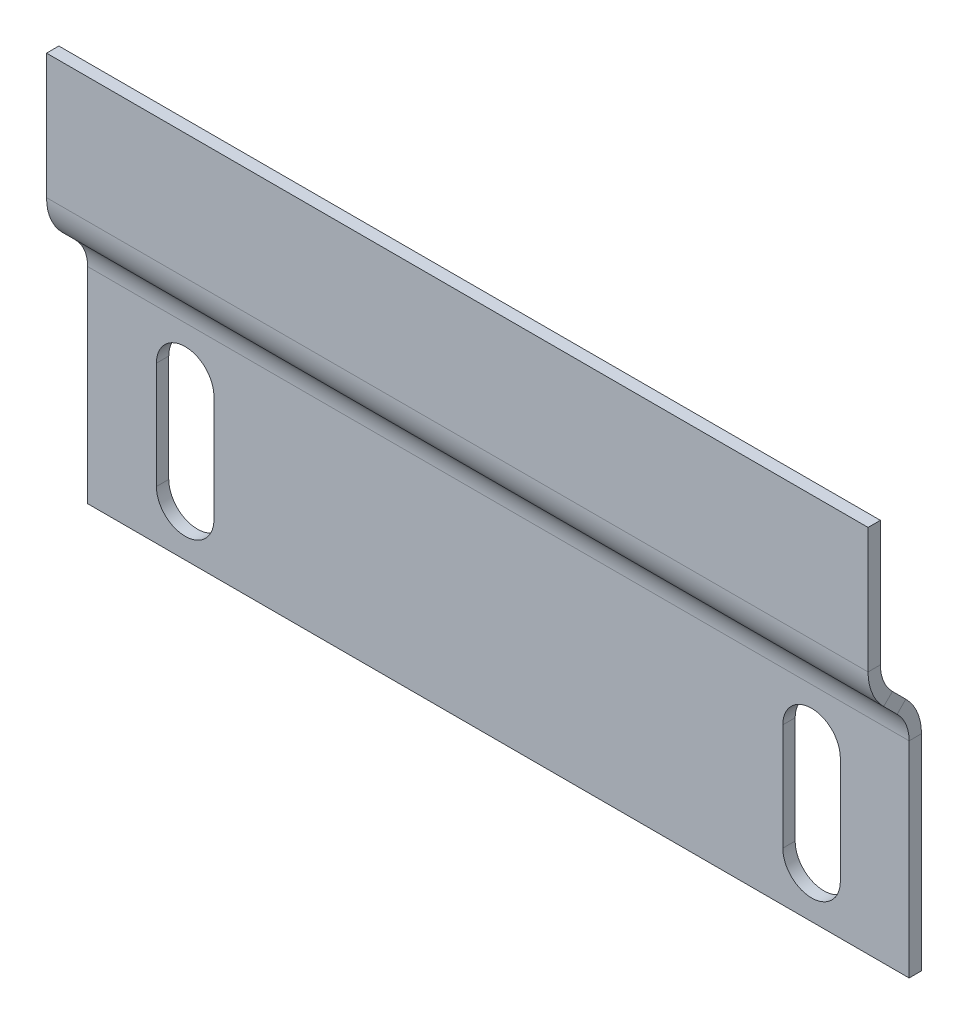
ISO-10303-21;
HEADER;
FILE_DESCRIPTION(('STEP AP214'),'2;1');
FILE_NAME('part.step','',(''),(''),'','','');
FILE_SCHEMA(('AUTOMOTIVE_DESIGN { 1 0 10303 214 1 1 1 1 }'));
ENDSEC;
DATA;
#1=APPLICATION_CONTEXT('core data for automotive mechanical design processes');
#2=APPLICATION_PROTOCOL_DEFINITION('international standard','automotive_design',2000,#1);
#3=PRODUCT_CONTEXT('',#1,'mechanical');
#4=PRODUCT('Part','Part','',(#3));
#5=PRODUCT_RELATED_PRODUCT_CATEGORY('part','',(#4));
#6=PRODUCT_DEFINITION_FORMATION('','',#4);
#7=PRODUCT_DEFINITION_CONTEXT('part definition',#1,'design');
#8=PRODUCT_DEFINITION('design','',#6,#7);
#9=PRODUCT_DEFINITION_SHAPE('','',#8);
#10=(LENGTH_UNIT() NAMED_UNIT(*) SI_UNIT(.MILLI.,.METRE.));
#11=(NAMED_UNIT(*) PLANE_ANGLE_UNIT() SI_UNIT($,.RADIAN.));
#12=(NAMED_UNIT(*) SI_UNIT($,.STERADIAN.) SOLID_ANGLE_UNIT());
#13=UNCERTAINTY_MEASURE_WITH_UNIT(LENGTH_MEASURE(1.E-05),#10,'distance_accuracy_value','');
#14=(GEOMETRIC_REPRESENTATION_CONTEXT(3) GLOBAL_UNCERTAINTY_ASSIGNED_CONTEXT((#13)) GLOBAL_UNIT_ASSIGNED_CONTEXT((#10,
#11,#12)) REPRESENTATION_CONTEXT('',''));
#15=CARTESIAN_POINT('',(0.,0.,0.));
#16=DIRECTION('',(0.,0.,1.));
#17=DIRECTION('',(1.,0.,0.));
#18=AXIS2_PLACEMENT_3D('',#15,#16,#17);
#19=CARTESIAN_POINT('',(34.6250000000001,-19.,-1.50100000000003));
#20=DIRECTION('',(-1.,0.,0.));
#21=DIRECTION('',(0.,0.,0.999999999999996));
#22=AXIS2_PLACEMENT_3D('',#19,#20,#21);
#23=PLANE('',#22);
#24=DIRECTION('',(0.,0.,0.999999999999996));
#25=VECTOR('',#24,1.);
#26=CARTESIAN_POINT('',(34.6250000000001,-6.,-1.50100000000006));
#27=LINE('',#26,#25);
#28=CARTESIAN_POINT('',(34.6250000000001,-5.99999999999998,-1.50000000000007));
#29=VERTEX_POINT('',#28);
#30=CARTESIAN_POINT('',(34.6250000000001,-5.99999999999998,0.));
#31=VERTEX_POINT('',#30);
#32=EDGE_CURVE('E311',#29,#31,#27,.T.);
#33=ORIENTED_EDGE('',*,*,#32,.T.);
#34=DIRECTION('',(0.,-1.,0.));
#35=VECTOR('',#34,1.);
#36=CARTESIAN_POINT('',(34.6250000000001,-19.,0.));
#37=LINE('',#36,#35);
#38=CARTESIAN_POINT('',(34.6250000000001,-19.,0.));
#39=VERTEX_POINT('',#38);
#40=EDGE_CURVE('E308',#31,#39,#37,.T.);
#41=ORIENTED_EDGE('',*,*,#40,.T.);
#42=DIRECTION('',(0.,0.,0.999999999999996));
#43=VECTOR('',#42,1.);
#44=CARTESIAN_POINT('',(34.6250000000001,-19.,-1.50100000000003));
#45=LINE('',#44,#43);
#46=CARTESIAN_POINT('',(34.6250000000001,-19.0000000000001,-1.50000000000001));
#47=VERTEX_POINT('',#46);
#48=EDGE_CURVE('E297',#47,#39,#45,.T.);
#49=ORIENTED_EDGE('',*,*,#48,.F.);
#50=DIRECTION('',(0.,-1.,0.));
#51=VECTOR('',#50,1.);
#52=CARTESIAN_POINT('',(34.6250000000001,-19.0000000000001,-1.50000000000001));
#53=LINE('',#52,#51);
#54=EDGE_CURVE('E241',#29,#47,#53,.T.);
#55=ORIENTED_EDGE('',*,*,#54,.F.);
#56=EDGE_LOOP('',(#33,#41,#49,#55));
#57=FACE_BOUND('',#56,.T.);
#58=ADVANCED_FACE('F41',(#57),#23,.F.);
#59=CARTESIAN_POINT('',(38.1250000000001,-6.00000000000001,-1.50100000000004));
#60=DIRECTION('',(0.,0.,0.999999999999996));
#61=DIRECTION('',(1.,0.,0.));
#62=AXIS2_PLACEMENT_3D('',#59,#60,#61);
#63=CYLINDRICAL_SURFACE('',#62,3.50000000000001);
#64=DIRECTION('',(0.,0.,0.999999999999996));
#65=VECTOR('',#64,1.);
#66=CARTESIAN_POINT('',(41.6250000000001,-5.99999999999999,-1.50100000000006));
#67=LINE('',#66,#65);
#68=CARTESIAN_POINT('',(41.6250000000001,-5.99999999999998,-1.50000000000005));
#69=VERTEX_POINT('',#68);
#70=CARTESIAN_POINT('',(41.6250000000001,-5.99999999999998,0.));
#71=VERTEX_POINT('',#70);
#72=EDGE_CURVE('E305',#69,#71,#67,.T.);
#73=ORIENTED_EDGE('',*,*,#72,.T.);
#74=CARTESIAN_POINT('',(38.1250000000001,-5.99999999999996,0.));
#75=DIRECTION('',(0.,0.,0.999999999999996));
#76=DIRECTION('',(-1.,0.,0.));
#77=AXIS2_PLACEMENT_3D('',#74,#75,#76);
#78=CIRCLE('',#77,3.50000000000001);
#79=EDGE_CURVE('E302',#71,#31,#78,.T.);
#80=ORIENTED_EDGE('',*,*,#79,.T.);
#81=ORIENTED_EDGE('',*,*,#32,.F.);
#82=CARTESIAN_POINT('',(38.1250000000001,-5.99999999999996,-1.50000000000007));
#83=DIRECTION('',(0.,0.,-0.999999999999996));
#84=DIRECTION('',(-1.,0.,0.));
#85=AXIS2_PLACEMENT_3D('',#82,#83,#84);
#86=CIRCLE('',#85,3.50000000000001);
#87=EDGE_CURVE('E243',#69,#29,#86,.F.);
#88=ORIENTED_EDGE('',*,*,#87,.F.);
#89=EDGE_LOOP('',(#73,#80,#81,#88));
#90=FACE_BOUND('',#89,.T.);
#91=ADVANCED_FACE('F336',(#90),#63,.F.);
#92=CARTESIAN_POINT('',(41.6250000000001,-19.0000000000001,-1.50100000000004));
#93=DIRECTION('',(1.,0.,0.));
#94=DIRECTION('',(0.,0.,-0.999999999999996));
#95=AXIS2_PLACEMENT_3D('',#92,#93,#94);
#96=PLANE('',#95);
#97=DIRECTION('',(0.,0.,0.999999999999996));
#98=VECTOR('',#97,1.);
#99=CARTESIAN_POINT('',(41.6250000000001,-19.0000000000001,-1.50100000000004));
#100=LINE('',#99,#98);
#101=CARTESIAN_POINT('',(41.6250000000001,-19.0000000000002,-1.50000000000003));
#102=VERTEX_POINT('',#101);
#103=CARTESIAN_POINT('',(41.6250000000001,-19.0000000000002,0.));
#104=VERTEX_POINT('',#103);
#105=EDGE_CURVE('E300',#102,#104,#100,.T.);
#106=ORIENTED_EDGE('',*,*,#105,.T.);
#107=DIRECTION('',(0.,1.,0.));
#108=VECTOR('',#107,1.);
#109=CARTESIAN_POINT('',(41.6250000000001,-19.0000000000002,0.));
#110=LINE('',#109,#108);
#111=EDGE_CURVE('E126',#104,#71,#110,.T.);
#112=ORIENTED_EDGE('',*,*,#111,.T.);
#113=ORIENTED_EDGE('',*,*,#72,.F.);
#114=DIRECTION('',(0.,1.,0.));
#115=VECTOR('',#114,1.);
#116=CARTESIAN_POINT('',(41.6250000000001,-19.0000000000002,-1.50000000000003));
#117=LINE('',#116,#115);
#118=EDGE_CURVE('E245',#102,#69,#117,.T.);
#119=ORIENTED_EDGE('',*,*,#118,.F.);
#120=EDGE_LOOP('',(#106,#112,#113,#119));
#121=FACE_BOUND('',#120,.T.);
#122=ADVANCED_FACE('F342',(#121),#96,.F.);
#123=CARTESIAN_POINT('',(38.1250000000001,-19.,-1.50100000000005));
#124=DIRECTION('',(0.,0.,0.999999999999996));
#125=DIRECTION('',(1.,0.,0.));
#126=AXIS2_PLACEMENT_3D('',#123,#124,#125);
#127=CYLINDRICAL_SURFACE('',#126,3.50000000000001);
#128=ORIENTED_EDGE('',*,*,#48,.T.);
#129=CARTESIAN_POINT('',(38.1250000000001,-19.0000000000001,0.));
#130=DIRECTION('',(0.,0.,0.999999999999996));
#131=DIRECTION('',(-1.,0.,0.));
#132=AXIS2_PLACEMENT_3D('',#129,#130,#131);
#133=CIRCLE('',#132,3.50000000000001);
#134=EDGE_CURVE('E294',#39,#104,#133,.T.);
#135=ORIENTED_EDGE('',*,*,#134,.T.);
#136=ORIENTED_EDGE('',*,*,#105,.F.);
#137=CARTESIAN_POINT('',(38.1250000000001,-19.0000000000001,-1.50000000000001));
#138=DIRECTION('',(0.,0.,-0.999999999999996));
#139=DIRECTION('',(-1.,0.,0.));
#140=AXIS2_PLACEMENT_3D('',#137,#138,#139);
#141=CIRCLE('',#140,3.50000000000001);
#142=EDGE_CURVE('E120',#47,#102,#141,.F.);
#143=ORIENTED_EDGE('',*,*,#142,.F.);
#144=EDGE_LOOP('',(#128,#135,#136,#143));
#145=FACE_BOUND('',#144,.T.);
#146=ADVANCED_FACE('F350',(#145),#127,.F.);
#147=CARTESIAN_POINT('',(-41.625,-18.9999999999999,-1.50100000000002));
#148=DIRECTION('',(-1.,0.,0.));
#149=DIRECTION('',(0.,0.,0.999999999999996));
#150=AXIS2_PLACEMENT_3D('',#147,#148,#149);
#151=PLANE('',#150);
#152=DIRECTION('',(0.,0.,0.999999999999996));
#153=VECTOR('',#152,1.);
#154=CARTESIAN_POINT('',(-41.625,-5.99999999999984,-1.50100000000002));
#155=LINE('',#154,#153);
#156=CARTESIAN_POINT('',(-41.625,-5.9999999999999,-1.50000000000005));
#157=VERTEX_POINT('',#156);
#158=CARTESIAN_POINT('',(-41.6249999999999,-5.9999999999999,0.));
#159=VERTEX_POINT('',#158);
#160=EDGE_CURVE('E291',#157,#159,#155,.T.);
#161=ORIENTED_EDGE('',*,*,#160,.T.);
#162=DIRECTION('',(0.,-1.,0.));
#163=VECTOR('',#162,1.);
#164=CARTESIAN_POINT('',(-41.6249999999999,-18.9999999999999,0.));
#165=LINE('',#164,#163);
#166=CARTESIAN_POINT('',(-41.6249999999999,-18.9999999999999,0.));
#167=VERTEX_POINT('',#166);
#168=EDGE_CURVE('E288',#159,#167,#165,.T.);
#169=ORIENTED_EDGE('',*,*,#168,.T.);
#170=DIRECTION('',(0.,0.,0.999999999999996));
#171=VECTOR('',#170,1.);
#172=CARTESIAN_POINT('',(-41.625,-18.9999999999999,-1.50100000000002));
#173=LINE('',#172,#171);
#174=CARTESIAN_POINT('',(-41.625,-18.9999999999998,-1.49999999999997));
#175=VERTEX_POINT('',#174);
#176=EDGE_CURVE('E274',#175,#167,#173,.T.);
#177=ORIENTED_EDGE('',*,*,#176,.F.);
#178=DIRECTION('',(0.,-1.,0.));
#179=VECTOR('',#178,1.);
#180=CARTESIAN_POINT('',(-41.625,-18.9999999999998,-1.49999999999997));
#181=LINE('',#180,#179);
#182=EDGE_CURVE('E248',#157,#175,#181,.T.);
#183=ORIENTED_EDGE('',*,*,#182,.F.);
#184=EDGE_LOOP('',(#161,#169,#177,#183));
#185=FACE_BOUND('',#184,.T.);
#186=ADVANCED_FACE('F353',(#185),#151,.F.);
#187=CARTESIAN_POINT('',(-38.125,-5.99999999999986,-1.50100000000002));
#188=DIRECTION('',(0.,0.,0.999999999999996));
#189=DIRECTION('',(1.,0.,0.));
#190=AXIS2_PLACEMENT_3D('',#187,#188,#189);
#191=CYLINDRICAL_SURFACE('',#190,3.50000000000001);
#192=DIRECTION('',(0.,0.,0.999999999999996));
#193=VECTOR('',#192,1.);
#194=CARTESIAN_POINT('',(-34.6249999999999,-5.99999999999987,-1.501));
#195=LINE('',#194,#193);
#196=CARTESIAN_POINT('',(-34.6249999999999,-5.99999999999993,-1.50000000000003));
#197=VERTEX_POINT('',#196);
#198=CARTESIAN_POINT('',(-34.6249999999999,-5.9999999999999,0.));
#199=VERTEX_POINT('',#198);
#200=EDGE_CURVE('E285',#197,#199,#195,.T.);
#201=ORIENTED_EDGE('',*,*,#200,.T.);
#202=CARTESIAN_POINT('',(-38.1249999999999,-5.9999999999999,0.));
#203=DIRECTION('',(0.,0.,0.999999999999996));
#204=DIRECTION('',(1.,0.,0.));
#205=AXIS2_PLACEMENT_3D('',#202,#203,#204);
#206=CIRCLE('',#205,3.50000000000001);
#207=EDGE_CURVE('E282',#199,#159,#206,.T.);
#208=ORIENTED_EDGE('',*,*,#207,.T.);
#209=ORIENTED_EDGE('',*,*,#160,.F.);
#210=CARTESIAN_POINT('',(-38.125,-5.99999999999993,-1.50000000000006));
#211=DIRECTION('',(0.,0.,-0.999999999999996));
#212=DIRECTION('',(-1.,0.,0.));
#213=AXIS2_PLACEMENT_3D('',#210,#211,#212);
#214=CIRCLE('',#213,3.50000000000001);
#215=EDGE_CURVE('E251',#197,#157,#214,.F.);
#216=ORIENTED_EDGE('',*,*,#215,.F.);
#217=EDGE_LOOP('',(#201,#208,#209,#216));
#218=FACE_BOUND('',#217,.T.);
#219=ADVANCED_FACE('F356',(#218),#191,.F.);
#220=CARTESIAN_POINT('',(-34.6249999999999,-18.9999999999999,-1.50100000000003));
#221=DIRECTION('',(1.,0.,0.));
#222=DIRECTION('',(0.,0.,-0.999999999999996));
#223=AXIS2_PLACEMENT_3D('',#220,#221,#222);
#224=PLANE('',#223);
#225=DIRECTION('',(0.,0.,0.999999999999996));
#226=VECTOR('',#225,1.);
#227=CARTESIAN_POINT('',(-34.6249999999999,-18.9999999999999,-1.50100000000003));
#228=LINE('',#227,#226);
#229=CARTESIAN_POINT('',(-34.6249999999999,-18.9999999999999,-1.50000000000005));
#230=VERTEX_POINT('',#229);
#231=CARTESIAN_POINT('',(-34.6249999999999,-18.9999999999999,0.));
#232=VERTEX_POINT('',#231);
#233=EDGE_CURVE('E279',#230,#232,#228,.T.);
#234=ORIENTED_EDGE('',*,*,#233,.T.);
#235=DIRECTION('',(0.,1.,0.));
#236=VECTOR('',#235,1.);
#237=CARTESIAN_POINT('',(-34.6249999999999,-18.9999999999999,0.));
#238=LINE('',#237,#236);
#239=EDGE_CURVE('E277',#232,#199,#238,.T.);
#240=ORIENTED_EDGE('',*,*,#239,.T.);
#241=ORIENTED_EDGE('',*,*,#200,.F.);
#242=DIRECTION('',(0.,1.,0.));
#243=VECTOR('',#242,1.);
#244=CARTESIAN_POINT('',(-34.6249999999999,-18.9999999999999,-1.50000000000005));
#245=LINE('',#244,#243);
#246=EDGE_CURVE('E254',#230,#197,#245,.T.);
#247=ORIENTED_EDGE('',*,*,#246,.F.);
#248=EDGE_LOOP('',(#234,#240,#241,#247));
#249=FACE_BOUND('',#248,.T.);
#250=ADVANCED_FACE('F360',(#249),#224,.F.);
#251=CARTESIAN_POINT('',(-38.125,-18.9999999999999,-1.50100000000001));
#252=DIRECTION('',(0.,0.,0.999999999999996));
#253=DIRECTION('',(1.,0.,0.));
#254=AXIS2_PLACEMENT_3D('',#251,#252,#253);
#255=CYLINDRICAL_SURFACE('',#254,3.50000000000001);
#256=ORIENTED_EDGE('',*,*,#176,.T.);
#257=CARTESIAN_POINT('',(-38.1249999999999,-18.9999999999999,0.));
#258=DIRECTION('',(0.,0.,0.999999999999996));
#259=DIRECTION('',(1.,0.,0.));
#260=AXIS2_PLACEMENT_3D('',#257,#258,#259);
#261=CIRCLE('',#260,3.50000000000001);
#262=EDGE_CURVE('E271',#167,#232,#261,.T.);
#263=ORIENTED_EDGE('',*,*,#262,.T.);
#264=ORIENTED_EDGE('',*,*,#233,.F.);
#265=CARTESIAN_POINT('',(-38.125,-18.9999999999999,-1.49999999999997));
#266=DIRECTION('',(0.,0.,-0.999999999999996));
#267=DIRECTION('',(-1.,0.,0.));
#268=AXIS2_PLACEMENT_3D('',#265,#266,#267);
#269=CIRCLE('',#268,3.50000000000001);
#270=EDGE_CURVE('E257',#175,#230,#269,.F.);
#271=ORIENTED_EDGE('',*,*,#270,.F.);
#272=EDGE_LOOP('',(#256,#263,#264,#271));
#273=FACE_BOUND('',#272,.T.);
#274=ADVANCED_FACE('F364',(#273),#255,.F.);
#275=CARTESIAN_POINT('',(-50.,-25.0000000000005,206.155281280883));
#276=DIRECTION('',(0.,1.,0.));
#277=DIRECTION('',(0.,0.,1.));
#278=AXIS2_PLACEMENT_3D('',#275,#276,#277);
#279=PLANE('',#278);
#280=DIRECTION('',(1.,0.,0.));
#281=VECTOR('',#280,1.);
#282=CARTESIAN_POINT('',(-50.,-25.,-1.5));
#283=LINE('',#282,#281);
#284=CARTESIAN_POINT('',(-49.9999999999999,-25.,-1.50000000000011));
#285=VERTEX_POINT('',#284);
#286=CARTESIAN_POINT('',(50.0000000000001,-25.,-1.50000000000005));
#287=VERTEX_POINT('',#286);
#288=EDGE_CURVE('E268',#285,#287,#283,.T.);
#289=ORIENTED_EDGE('',*,*,#288,.T.);
#290=DIRECTION('',(0.,0.,-1.));
#291=VECTOR('',#290,1.);
#292=CARTESIAN_POINT('',(50.,-25.0000000000005,206.155281280883));
#293=LINE('',#292,#291);
#294=CARTESIAN_POINT('',(50.0000000000001,-25.,0.));
#295=VERTEX_POINT('',#294);
#296=EDGE_CURVE('E234',#295,#287,#293,.T.);
#297=ORIENTED_EDGE('',*,*,#296,.F.);
#298=DIRECTION('',(1.,0.,0.));
#299=VECTOR('',#298,1.);
#300=CARTESIAN_POINT('',(-49.9999999999999,-25.,0.));
#301=LINE('',#300,#299);
#302=CARTESIAN_POINT('',(-49.9999999999999,-25.,0.));
#303=VERTEX_POINT('',#302);
#304=EDGE_CURVE('E51',#303,#295,#301,.T.);
#305=ORIENTED_EDGE('',*,*,#304,.F.);
#306=DIRECTION('',(0.,0.,-1.));
#307=VECTOR('',#306,1.);
#308=CARTESIAN_POINT('',(-50.,-25.0000000000005,206.155281280883));
#309=LINE('',#308,#307);
#310=EDGE_CURVE('E265',#303,#285,#309,.T.);
#311=ORIENTED_EDGE('',*,*,#310,.T.);
#312=EDGE_LOOP('',(#289,#297,#305,#311));
#313=FACE_BOUND('',#312,.T.);
#314=ADVANCED_FACE('F368',(#313),#279,.F.);
#315=CARTESIAN_POINT('',(-50.,-25.0000000000005,206.155281280883));
#316=DIRECTION('',(1.,0.,0.));
#317=DIRECTION('',(0.,1.,0.));
#318=AXIS2_PLACEMENT_3D('',#315,#316,#317);
#319=PLANE('',#318);
#320=DIRECTION('',(0.,-1.,0.));
#321=VECTOR('',#320,1.);
#322=CARTESIAN_POINT('',(-50.,-25.,-1.5));
#323=LINE('',#322,#321);
#324=CARTESIAN_POINT('',(-50.,0.,-1.50000000000003));
#325=VERTEX_POINT('',#324);
#326=EDGE_CURVE('E263',#325,#285,#323,.T.);
#327=ORIENTED_EDGE('',*,*,#326,.T.);
#328=ORIENTED_EDGE('',*,*,#310,.F.);
#329=DIRECTION('',(0.,-1.,0.));
#330=VECTOR('',#329,1.);
#331=CARTESIAN_POINT('',(-49.9999999999999,-25.,0.));
#332=LINE('',#331,#330);
#333=CARTESIAN_POINT('',(-50.,0.,0.));
#334=VERTEX_POINT('',#333);
#335=EDGE_CURVE('E232',#334,#303,#332,.T.);
#336=ORIENTED_EDGE('',*,*,#335,.F.);
#337=DIRECTION('',(0.,0.,-1.));
#338=VECTOR('',#337,1.);
#339=CARTESIAN_POINT('',(-50.,-4.19369400317393E-13,206.155281280883));
#340=LINE('',#339,#338);
#341=EDGE_CURVE('E260',#334,#325,#340,.T.);
#342=ORIENTED_EDGE('',*,*,#341,.T.);
#343=EDGE_LOOP('',(#327,#328,#336,#342));
#344=FACE_BOUND('',#343,.T.);
#345=ADVANCED_FACE('F372',(#344),#319,.F.);
#346=CARTESIAN_POINT('',(0.,0.,-1.50000000000004));
#347=DIRECTION('',(0.,0.,-0.999999999999996));
#348=DIRECTION('',(-1.,0.,0.));
#349=AXIS2_PLACEMENT_3D('',#346,#347,#348);
#350=PLANE('',#349);
#351=ORIENTED_EDGE('',*,*,#270,.T.);
#352=ORIENTED_EDGE('',*,*,#246,.T.);
#353=ORIENTED_EDGE('',*,*,#215,.T.);
#354=ORIENTED_EDGE('',*,*,#182,.T.);
#355=EDGE_LOOP('',(#351,#352,#353,#354));
#356=FACE_BOUND('',#355,.T.);
#357=ORIENTED_EDGE('',*,*,#142,.T.);
#358=ORIENTED_EDGE('',*,*,#118,.T.);
#359=ORIENTED_EDGE('',*,*,#87,.T.);
#360=ORIENTED_EDGE('',*,*,#54,.T.);
#361=EDGE_LOOP('',(#357,#358,#359,#360));
#362=FACE_BOUND('',#361,.T.);
#363=ORIENTED_EDGE('',*,*,#326,.F.);
#364=DIRECTION('',(1.,0.,0.));
#365=VECTOR('',#364,1.);
#366=CARTESIAN_POINT('',(0.,0.,-1.50000000000006));
#367=LINE('',#366,#365);
#368=CARTESIAN_POINT('',(50.0000000000001,0.,-1.50000000000004));
#369=VERTEX_POINT('',#368);
#370=EDGE_CURVE('E238',#325,#369,#367,.T.);
#371=ORIENTED_EDGE('',*,*,#370,.T.);
#372=DIRECTION('',(0.,1.,0.));
#373=VECTOR('',#372,1.);
#374=CARTESIAN_POINT('',(50.0000000000001,-25.,-1.50000000000005));
#375=LINE('',#374,#373);
#376=EDGE_CURVE('E236',#287,#369,#375,.T.);
#377=ORIENTED_EDGE('',*,*,#376,.F.);
#378=ORIENTED_EDGE('',*,*,#288,.F.);
#379=EDGE_LOOP('',(#363,#371,#377,#378));
#380=FACE_BOUND('',#379,.T.);
#381=ADVANCED_FACE('F333',(#356,#362,#380),#350,.T.);
#382=CARTESIAN_POINT('',(50.,-25.0000000000005,206.155281280883));
#383=DIRECTION('',(-1.,0.,0.));
#384=DIRECTION('',(0.,-1.,0.));
#385=AXIS2_PLACEMENT_3D('',#382,#383,#384);
#386=PLANE('',#385);
#387=ORIENTED_EDGE('',*,*,#376,.T.);
#388=DIRECTION('',(0.,0.,-1.));
#389=VECTOR('',#388,1.);
#390=CARTESIAN_POINT('',(50.,-4.47124975933022E-13,206.155281280883));
#391=LINE('',#390,#389);
#392=CARTESIAN_POINT('',(50.0000000000001,0.,0.));
#393=VERTEX_POINT('',#392);
#394=EDGE_CURVE('E211',#393,#369,#391,.T.);
#395=ORIENTED_EDGE('',*,*,#394,.F.);
#396=DIRECTION('',(0.,1.,0.));
#397=VECTOR('',#396,1.);
#398=CARTESIAN_POINT('',(50.0000000000001,-25.,0.));
#399=LINE('',#398,#397);
#400=EDGE_CURVE('E11',#295,#393,#399,.T.);
#401=ORIENTED_EDGE('',*,*,#400,.F.);
#402=ORIENTED_EDGE('',*,*,#296,.T.);
#403=EDGE_LOOP('',(#387,#395,#401,#402));
#404=FACE_BOUND('',#403,.T.);
#405=ADVANCED_FACE('F321',(#404),#386,.F.);
#406=CARTESIAN_POINT('',(0.,0.,0.));
#407=DIRECTION('',(0.,0.,-0.999999999999996));
#408=DIRECTION('',(-1.,0.,0.));
#409=AXIS2_PLACEMENT_3D('',#406,#407,#408);
#410=PLANE('',#409);
#411=ORIENTED_EDGE('',*,*,#239,.F.);
#412=ORIENTED_EDGE('',*,*,#262,.F.);
#413=ORIENTED_EDGE('',*,*,#168,.F.);
#414=ORIENTED_EDGE('',*,*,#207,.F.);
#415=EDGE_LOOP('',(#411,#412,#413,#414));
#416=FACE_BOUND('',#415,.T.);
#417=ORIENTED_EDGE('',*,*,#111,.F.);
#418=ORIENTED_EDGE('',*,*,#134,.F.);
#419=ORIENTED_EDGE('',*,*,#40,.F.);
#420=ORIENTED_EDGE('',*,*,#79,.F.);
#421=EDGE_LOOP('',(#417,#418,#419,#420));
#422=FACE_BOUND('',#421,.T.);
#423=DIRECTION('',(1.,0.,0.));
#424=VECTOR('',#423,1.);
#425=CARTESIAN_POINT('',(0.,0.,0.));
#426=LINE('',#425,#424);
#427=EDGE_CURVE('E45',#334,#393,#426,.T.);
#428=ORIENTED_EDGE('',*,*,#427,.F.);
#429=ORIENTED_EDGE('',*,*,#335,.T.);
#430=ORIENTED_EDGE('',*,*,#304,.T.);
#431=ORIENTED_EDGE('',*,*,#400,.T.);
#432=EDGE_LOOP('',(#428,#429,#430,#431));
#433=FACE_BOUND('',#432,.T.);
#434=ADVANCED_FACE('F43',(#416,#422,#433),#410,.F.);
#435=CARTESIAN_POINT('',(0.,1.40287196591127,-2.78951618951393));
#436=DIRECTION('',(0.,0.707106781186552,-0.707106781186544));
#437=DIRECTION('',(-1.,0.,0.));
#438=AXIS2_PLACEMENT_3D('',#435,#436,#437);
#439=PLANE('',#438);
#440=DIRECTION('',(0.,-0.707106781186547,-0.707106781186544));
#441=VECTOR('',#440,1.);
#442=CARTESIAN_POINT('',(-49.9999999999999,-16.2747975637524,-20.4671857191775));
#443=LINE('',#442,#441);
#444=CARTESIAN_POINT('',(-50.,6.2279220613579,2.03553390593272));
#445=VERTEX_POINT('',#444);
#446=CARTESIAN_POINT('',(-50.,4.59619407771259,0.403805922287424));
#447=VERTEX_POINT('',#446);
#448=EDGE_CURVE('E448',#445,#447,#443,.T.);
#449=ORIENTED_EDGE('',*,*,#448,.F.);
#450=DIRECTION('',(1.,0.,0.));
#451=VECTOR('',#450,1.);
#452=CARTESIAN_POINT('',(0.,6.2279220613579,2.03553390593273));
#453=LINE('',#452,#451);
#454=CARTESIAN_POINT('',(50.0000000000001,6.2279220613579,2.0355339059327));
#455=VERTEX_POINT('',#454);
#456=EDGE_CURVE('E142',#445,#455,#453,.T.);
#457=ORIENTED_EDGE('',*,*,#456,.T.);
#458=DIRECTION('',(0.,0.707106781186547,0.707106781186544));
#459=VECTOR('',#458,1.);
#460=CARTESIAN_POINT('',(50.0000000000001,-16.2747975637524,-20.4671857191776));
#461=LINE('',#460,#459);
#462=CARTESIAN_POINT('',(50.,4.5961940777126,0.403805922287409));
#463=VERTEX_POINT('',#462);
#464=EDGE_CURVE('E203',#463,#455,#461,.T.);
#465=ORIENTED_EDGE('',*,*,#464,.F.);
#466=DIRECTION('',(1.,0.,0.));
#467=VECTOR('',#466,1.);
#468=CARTESIAN_POINT('',(0.,4.59619407771262,0.403805922287402));
#469=LINE('',#468,#467);
#470=EDGE_CURVE('E194',#447,#463,#469,.T.);
#471=ORIENTED_EDGE('',*,*,#470,.F.);
#472=EDGE_LOOP('',(#449,#457,#465,#471));
#473=FACE_BOUND('',#472,.T.);
#474=ADVANCED_FACE('F214',(#473),#439,.T.);
#475=CARTESIAN_POINT('',(-50.,124.123547438584,-160.865530721513));
#476=DIRECTION('',(-1.,0.,0.));
#477=DIRECTION('',(0.,-0.707106781186545,-0.70710678118655));
#478=AXIS2_PLACEMENT_3D('',#475,#476,#477);
#479=PLANE('',#478);
#480=DIRECTION('',(0.,-0.707106781186547,-0.707106781186544));
#481=VECTOR('',#480,1.);
#482=CARTESIAN_POINT('',(-49.9999999999998,-17.3354577355322,-19.4065255473977));
#483=LINE('',#482,#481);
#484=CARTESIAN_POINT('',(-50.,5.16726188957809,3.09619407771252));
#485=VERTEX_POINT('',#484);
#486=CARTESIAN_POINT('',(-50.,3.53553390593283,1.46446609406718));
#487=VERTEX_POINT('',#486);
#488=EDGE_CURVE('E442',#485,#487,#483,.T.);
#489=ORIENTED_EDGE('',*,*,#488,.F.);
#490=DIRECTION('',(0.,-0.707106781186551,0.707106781186544));
#491=VECTOR('',#490,1.);
#492=CARTESIAN_POINT('',(-50.0000000000001,146.626267063694,-138.362811096402));
#493=LINE('',#492,#491);
#494=EDGE_CURVE('E224',#445,#485,#493,.T.);
#495=ORIENTED_EDGE('',*,*,#494,.F.);
#496=ORIENTED_EDGE('',*,*,#448,.T.);
#497=DIRECTION('',(0.,-0.707106781186551,0.707106781186544));
#498=VECTOR('',#497,1.);
#499=CARTESIAN_POINT('',(-50.0000000000001,144.994539080049,-139.994539080048));
#500=LINE('',#499,#498);
#501=EDGE_CURVE('E202',#447,#487,#500,.T.);
#502=ORIENTED_EDGE('',*,*,#501,.T.);
#503=EDGE_LOOP('',(#489,#495,#496,#502));
#504=FACE_BOUND('',#503,.T.);
#505=ADVANCED_FACE('F330',(#504),#479,.T.);
#506=CARTESIAN_POINT('',(50.,124.123547438584,-160.865530721513));
#507=DIRECTION('',(1.,0.,0.));
#508=DIRECTION('',(0.,0.707106781186545,0.70710678118655));
#509=AXIS2_PLACEMENT_3D('',#506,#507,#508);
#510=PLANE('',#509);
#511=DIRECTION('',(0.,0.707106781186547,0.707106781186544));
#512=VECTOR('',#511,1.);
#513=CARTESIAN_POINT('',(50.0000000000002,-17.3354577355323,-19.4065255473978));
#514=LINE('',#513,#512);
#515=CARTESIAN_POINT('',(50.,3.53553390593279,1.46446609406721));
#516=VERTEX_POINT('',#515);
#517=CARTESIAN_POINT('',(50.,5.16726188957808,3.09619407771251));
#518=VERTEX_POINT('',#517);
#519=EDGE_CURVE('E221',#516,#518,#514,.T.);
#520=ORIENTED_EDGE('',*,*,#519,.F.);
#521=DIRECTION('',(0.,-0.707106781186551,0.707106781186544));
#522=VECTOR('',#521,1.);
#523=CARTESIAN_POINT('',(49.9999999999999,144.994539080049,-139.994539080048));
#524=LINE('',#523,#522);
#525=EDGE_CURVE('E208',#463,#516,#524,.T.);
#526=ORIENTED_EDGE('',*,*,#525,.F.);
#527=ORIENTED_EDGE('',*,*,#464,.T.);
#528=DIRECTION('',(0.,-0.707106781186551,0.707106781186544));
#529=VECTOR('',#528,1.);
#530=CARTESIAN_POINT('',(50.,146.626267063694,-138.362811096402));
#531=LINE('',#530,#529);
#532=EDGE_CURVE('E222',#455,#518,#531,.T.);
#533=ORIENTED_EDGE('',*,*,#532,.T.);
#534=EDGE_LOOP('',(#520,#526,#527,#533));
#535=FACE_BOUND('',#534,.T.);
#536=ADVANCED_FACE('F220',(#535),#510,.T.);
#537=CARTESIAN_POINT('',(0.,0.342211794131454,-1.72885601773412));
#538=DIRECTION('',(0.,0.707106781186552,-0.707106781186544));
#539=DIRECTION('',(-1.,0.,0.));
#540=AXIS2_PLACEMENT_3D('',#537,#538,#539);
#541=PLANE('',#540);
#542=DIRECTION('',(1.,0.,0.));
#543=VECTOR('',#542,1.);
#544=CARTESIAN_POINT('',(0.,5.16726188957808,3.09619407771252));
#545=LINE('',#544,#543);
#546=EDGE_CURVE('E410',#485,#518,#545,.T.);
#547=ORIENTED_EDGE('',*,*,#546,.F.);
#548=ORIENTED_EDGE('',*,*,#488,.T.);
#549=DIRECTION('',(1.,0.,0.));
#550=VECTOR('',#549,1.);
#551=CARTESIAN_POINT('',(0.,3.53553390593278,1.46446609406721));
#552=LINE('',#551,#550);
#553=EDGE_CURVE('E445',#487,#516,#552,.T.);
#554=ORIENTED_EDGE('',*,*,#553,.T.);
#555=ORIENTED_EDGE('',*,*,#519,.T.);
#556=EDGE_LOOP('',(#547,#548,#554,#555));
#557=FACE_BOUND('',#556,.T.);
#558=ADVANCED_FACE('F483',(#557),#541,.F.);
#559=CARTESIAN_POINT('',(-49.9999999999999,25.0000000000006,-197.30820323517));
#560=DIRECTION('',(0.,1.,0.));
#561=DIRECTION('',(0.,0.,1.));
#562=AXIS2_PLACEMENT_3D('',#559,#560,#561);
#563=PLANE('',#562);
#564=DIRECTION('',(-1.,0.,0.));
#565=VECTOR('',#564,1.);
#566=CARTESIAN_POINT('',(-49.9999999999999,25.0000000000002,4.99999999999996));
#567=LINE('',#566,#565);
#568=CARTESIAN_POINT('',(50.0000000000001,25.,4.99999999999996));
#569=VERTEX_POINT('',#568);
#570=CARTESIAN_POINT('',(-49.9999999999999,25.0000000000001,5.00000000000006));
#571=VERTEX_POINT('',#570);
#572=EDGE_CURVE('E407',#569,#571,#567,.T.);
#573=ORIENTED_EDGE('',*,*,#572,.F.);
#574=DIRECTION('',(0.,0.,1.));
#575=VECTOR('',#574,1.);
#576=CARTESIAN_POINT('',(50.0000000000002,25.0000000000005,-197.30820323517));
#577=LINE('',#576,#575);
#578=CARTESIAN_POINT('',(50.0000000000001,25.,3.50000000000011));
#579=VERTEX_POINT('',#578);
#580=EDGE_CURVE('E424',#579,#569,#577,.T.);
#581=ORIENTED_EDGE('',*,*,#580,.F.);
#582=DIRECTION('',(-1.,0.,0.));
#583=VECTOR('',#582,1.);
#584=CARTESIAN_POINT('',(-49.9999999999999,25.0000000000002,3.49999999999996));
#585=LINE('',#584,#583);
#586=CARTESIAN_POINT('',(-49.9999999999999,25.0000000000002,3.49999999999996));
#587=VERTEX_POINT('',#586);
#588=EDGE_CURVE('E432',#579,#587,#585,.T.);
#589=ORIENTED_EDGE('',*,*,#588,.T.);
#590=DIRECTION('',(0.,0.,1.));
#591=VECTOR('',#590,1.);
#592=CARTESIAN_POINT('',(-49.9999999999999,25.0000000000006,-197.30820323517));
#593=LINE('',#592,#591);
#594=EDGE_CURVE('E429',#587,#571,#593,.T.);
#595=ORIENTED_EDGE('',*,*,#594,.T.);
#596=EDGE_LOOP('',(#573,#581,#589,#595));
#597=FACE_BOUND('',#596,.T.);
#598=ADVANCED_FACE('F471',(#597),#563,.T.);
#599=CARTESIAN_POINT('',(50.0000000000002,-26.5762347563545,-197.30820323517));
#600=DIRECTION('',(1.,0.,0.));
#601=DIRECTION('',(0.,1.,0.));
#602=AXIS2_PLACEMENT_3D('',#599,#600,#601);
#603=PLANE('',#602);
#604=DIRECTION('',(0.,1.,0.));
#605=VECTOR('',#604,1.);
#606=CARTESIAN_POINT('',(50.0000000000002,-26.576234756355,5.00000000000004));
#607=LINE('',#606,#605);
#608=CARTESIAN_POINT('',(50.0000000000001,9.76345596729063,4.99999999999998));
#609=VERTEX_POINT('',#608);
#610=EDGE_CURVE('E411',#609,#569,#607,.T.);
#611=ORIENTED_EDGE('',*,*,#610,.F.);
#612=DIRECTION('',(0.,0.,1.));
#613=VECTOR('',#612,1.);
#614=CARTESIAN_POINT('',(50.0000000000002,9.76345596729111,-197.30820323517));
#615=LINE('',#614,#613);
#616=CARTESIAN_POINT('',(50.0000000000001,9.76345596729064,3.49999999999999));
#617=VERTEX_POINT('',#616);
#618=EDGE_CURVE('E403',#617,#609,#615,.T.);
#619=ORIENTED_EDGE('',*,*,#618,.F.);
#620=DIRECTION('',(0.,1.,0.));
#621=VECTOR('',#620,1.);
#622=CARTESIAN_POINT('',(50.0000000000001,-26.576234756355,3.50000000000002));
#623=LINE('',#622,#621);
#624=EDGE_CURVE('E426',#617,#579,#623,.T.);
#625=ORIENTED_EDGE('',*,*,#624,.T.);
#626=ORIENTED_EDGE('',*,*,#580,.T.);
#627=EDGE_LOOP('',(#611,#619,#625,#626));
#628=FACE_BOUND('',#627,.T.);
#629=ADVANCED_FACE('F476',(#628),#603,.T.);
#630=CARTESIAN_POINT('',(0.,-1.57623475635495,3.50000000000003));
#631=DIRECTION('',(0.,0.,-0.999999999999996));
#632=DIRECTION('',(-1.,0.,0.));
#633=AXIS2_PLACEMENT_3D('',#630,#631,#632);
#634=PLANE('',#633);
#635=DIRECTION('',(1.,0.,0.));
#636=VECTOR('',#635,1.);
#637=CARTESIAN_POINT('',(0.,9.76345596729063,3.50000000000001));
#638=LINE('',#637,#636);
#639=CARTESIAN_POINT('',(-49.9999999999999,9.76345596729065,3.5));
#640=VERTEX_POINT('',#639);
#641=EDGE_CURVE('E435',#640,#617,#638,.T.);
#642=ORIENTED_EDGE('',*,*,#641,.F.);
#643=DIRECTION('',(0.,-1.,0.));
#644=VECTOR('',#643,1.);
#645=CARTESIAN_POINT('',(-49.9999999999999,-26.576234756355,3.50000000000003));
#646=LINE('',#645,#644);
#647=EDGE_CURVE('E421',#587,#640,#646,.T.);
#648=ORIENTED_EDGE('',*,*,#647,.F.);
#649=ORIENTED_EDGE('',*,*,#588,.F.);
#650=ORIENTED_EDGE('',*,*,#624,.F.);
#651=EDGE_LOOP('',(#642,#648,#649,#650));
#652=FACE_BOUND('',#651,.T.);
#653=ADVANCED_FACE('F474',(#652),#634,.T.);
#654=CARTESIAN_POINT('',(-49.9999999999998,-26.5762347563545,-197.30820323517));
#655=DIRECTION('',(-1.,0.,0.));
#656=DIRECTION('',(0.,-1.,0.));
#657=AXIS2_PLACEMENT_3D('',#654,#655,#656);
#658=PLANE('',#657);
#659=DIRECTION('',(0.,-1.,0.));
#660=VECTOR('',#659,1.);
#661=CARTESIAN_POINT('',(-49.9999999999998,-26.576234756355,5.00000000000006));
#662=LINE('',#661,#660);
#663=CARTESIAN_POINT('',(-49.9999999999999,9.76345596729065,5.00000000000003));
#664=VERTEX_POINT('',#663);
#665=EDGE_CURVE('E416',#571,#664,#662,.T.);
#666=ORIENTED_EDGE('',*,*,#665,.F.);
#667=ORIENTED_EDGE('',*,*,#594,.F.);
#668=ORIENTED_EDGE('',*,*,#647,.T.);
#669=DIRECTION('',(0.,0.,1.));
#670=VECTOR('',#669,1.);
#671=CARTESIAN_POINT('',(-49.9999999999998,9.76345596729113,-197.30820323517));
#672=LINE('',#671,#670);
#673=EDGE_CURVE('E419',#640,#664,#672,.T.);
#674=ORIENTED_EDGE('',*,*,#673,.T.);
#675=EDGE_LOOP('',(#666,#667,#668,#674));
#676=FACE_BOUND('',#675,.T.);
#677=ADVANCED_FACE('F463',(#676),#658,.T.);
#678=CARTESIAN_POINT('',(0.,-1.57623475635495,5.00000000000002));
#679=DIRECTION('',(0.,0.,-0.999999999999996));
#680=DIRECTION('',(-1.,0.,0.));
#681=AXIS2_PLACEMENT_3D('',#678,#679,#680);
#682=PLANE('',#681);
#683=ORIENTED_EDGE('',*,*,#665,.T.);
#684=DIRECTION('',(1.,0.,0.));
#685=VECTOR('',#684,1.);
#686=CARTESIAN_POINT('',(0.,9.76345596729063,5.00000000000002));
#687=LINE('',#686,#685);
#688=EDGE_CURVE('E414',#664,#609,#687,.T.);
#689=ORIENTED_EDGE('',*,*,#688,.T.);
#690=ORIENTED_EDGE('',*,*,#610,.T.);
#691=ORIENTED_EDGE('',*,*,#572,.T.);
#692=EDGE_LOOP('',(#683,#689,#690,#691));
#693=FACE_BOUND('',#692,.T.);
#694=ADVANCED_FACE('F466',(#693),#682,.F.);
#695=CARTESIAN_POINT('',(50.0000000000001,9.76345596729065,-1.50000000000001));
#696=DIRECTION('',(1.,0.,0.));
#697=DIRECTION('',(0.,1.,0.));
#698=AXIS2_PLACEMENT_3D('',#695,#696,#697);
#699=PLANE('',#698);
#700=ORIENTED_EDGE('',*,*,#532,.F.);
#701=CARTESIAN_POINT('',(50.,9.76345596729065,-1.50000000000001));
#702=DIRECTION('',(-1.,0.,0.));
#703=DIRECTION('',(0.,0.,1.));
#704=AXIS2_PLACEMENT_3D('',#701,#702,#703);
#705=CIRCLE('',#704,5.);
#706=EDGE_CURVE('E390',#455,#617,#705,.T.);
#707=ORIENTED_EDGE('',*,*,#706,.T.);
#708=ORIENTED_EDGE('',*,*,#618,.T.);
#709=CARTESIAN_POINT('',(50.,9.76345596729065,-1.50000000000001));
#710=DIRECTION('',(-1.,0.,0.));
#711=DIRECTION('',(0.,0.,1.));
#712=AXIS2_PLACEMENT_3D('',#709,#710,#711);
#713=CIRCLE('',#712,6.49999999999998);
#714=EDGE_CURVE('E398',#518,#609,#713,.T.);
#715=ORIENTED_EDGE('',*,*,#714,.F.);
#716=EDGE_LOOP('',(#700,#707,#708,#715));
#717=FACE_BOUND('',#716,.T.);
#718=ADVANCED_FACE('F479',(#717),#699,.T.);
#719=CARTESIAN_POINT('',(-49.9999999999999,9.76345596729066,-1.5));
#720=DIRECTION('',(-1.,0.,0.));
#721=DIRECTION('',(0.,-1.,0.));
#722=AXIS2_PLACEMENT_3D('',#719,#720,#721);
#723=PLANE('',#722);
#724=CARTESIAN_POINT('',(-49.9999999999999,9.76345596729066,-1.5));
#725=DIRECTION('',(-1.,0.,0.));
#726=DIRECTION('',(0.,0.,1.));
#727=AXIS2_PLACEMENT_3D('',#724,#725,#726);
#728=CIRCLE('',#727,5.);
#729=EDGE_CURVE('E393',#640,#445,#728,.F.);
#730=ORIENTED_EDGE('',*,*,#729,.T.);
#731=ORIENTED_EDGE('',*,*,#494,.T.);
#732=CARTESIAN_POINT('',(-49.9999999999999,9.76345596729066,-1.5));
#733=DIRECTION('',(-1.,0.,0.));
#734=DIRECTION('',(0.,0.,1.));
#735=AXIS2_PLACEMENT_3D('',#732,#733,#734);
#736=CIRCLE('',#735,6.49999999999998);
#737=EDGE_CURVE('E401',#664,#485,#736,.F.);
#738=ORIENTED_EDGE('',*,*,#737,.F.);
#739=ORIENTED_EDGE('',*,*,#673,.F.);
#740=EDGE_LOOP('',(#730,#731,#738,#739));
#741=FACE_BOUND('',#740,.T.);
#742=ADVANCED_FACE('F460',(#741),#723,.T.);
#743=CARTESIAN_POINT('',(162.527143355027,9.76345596729064,-1.50000000000003));
#744=DIRECTION('',(-1.,0.,0.));
#745=DIRECTION('',(0.,0.,1.));
#746=AXIS2_PLACEMENT_3D('',#743,#744,#745);
#747=CYLINDRICAL_SURFACE('',#746,6.49999999999998);
#748=ORIENTED_EDGE('',*,*,#688,.F.);
#749=ORIENTED_EDGE('',*,*,#737,.T.);
#750=ORIENTED_EDGE('',*,*,#546,.T.);
#751=ORIENTED_EDGE('',*,*,#714,.T.);
#752=EDGE_LOOP('',(#748,#749,#750,#751));
#753=FACE_BOUND('',#752,.T.);
#754=ADVANCED_FACE('F481',(#753),#747,.T.);
#755=CARTESIAN_POINT('',(162.527143355027,9.76345596729064,-1.50000000000003));
#756=DIRECTION('',(-1.,0.,0.));
#757=DIRECTION('',(0.,0.,1.));
#758=AXIS2_PLACEMENT_3D('',#755,#756,#757);
#759=CYLINDRICAL_SURFACE('',#758,5.);
#760=ORIENTED_EDGE('',*,*,#641,.T.);
#761=ORIENTED_EDGE('',*,*,#706,.F.);
#762=ORIENTED_EDGE('',*,*,#456,.F.);
#763=ORIENTED_EDGE('',*,*,#729,.F.);
#764=EDGE_LOOP('',(#760,#761,#762,#763));
#765=FACE_BOUND('',#764,.T.);
#766=ADVANCED_FACE('F458',(#765),#759,.F.);
#767=CARTESIAN_POINT('',(50.,0.,4.99999999999994));
#768=DIRECTION('',(-1.,0.,0.));
#769=DIRECTION('',(0.,-1.,0.));
#770=AXIS2_PLACEMENT_3D('',#767,#768,#769);
#771=PLANE('',#770);
#772=ORIENTED_EDGE('',*,*,#525,.T.);
#773=CARTESIAN_POINT('',(50.0000000000001,0.,4.99999999999994));
#774=DIRECTION('',(1.,0.,0.));
#775=DIRECTION('',(0.,0.,-1.));
#776=AXIS2_PLACEMENT_3D('',#773,#774,#775);
#777=CIRCLE('',#776,5.);
#778=EDGE_CURVE('E317',#393,#516,#777,.T.);
#779=ORIENTED_EDGE('',*,*,#778,.F.);
#780=ORIENTED_EDGE('',*,*,#394,.T.);
#781=CARTESIAN_POINT('',(50.0000000000001,0.,4.99999999999994));
#782=DIRECTION('',(1.,0.,0.));
#783=DIRECTION('',(0.,0.,-1.));
#784=AXIS2_PLACEMENT_3D('',#781,#782,#783);
#785=CIRCLE('',#784,6.49999999999998);
#786=EDGE_CURVE('E198',#369,#463,#785,.T.);
#787=ORIENTED_EDGE('',*,*,#786,.T.);
#788=EDGE_LOOP('',(#772,#779,#780,#787));
#789=FACE_BOUND('',#788,.T.);
#790=ADVANCED_FACE('F206',(#789),#771,.F.);
#791=CARTESIAN_POINT('',(-50.,0.,4.99999999999996));
#792=DIRECTION('',(1.,0.,0.));
#793=DIRECTION('',(0.,1.,0.));
#794=AXIS2_PLACEMENT_3D('',#791,#792,#793);
#795=PLANE('',#794);
#796=CARTESIAN_POINT('',(-50.,0.,4.99999999999996));
#797=DIRECTION('',(1.,0.,0.));
#798=DIRECTION('',(0.,0.,-1.));
#799=AXIS2_PLACEMENT_3D('',#796,#797,#798);
#800=CIRCLE('',#799,5.);
#801=EDGE_CURVE('E134',#487,#334,#800,.F.);
#802=ORIENTED_EDGE('',*,*,#801,.F.);
#803=ORIENTED_EDGE('',*,*,#501,.F.);
#804=CARTESIAN_POINT('',(-50.,0.,4.99999999999996));
#805=DIRECTION('',(1.,0.,0.));
#806=DIRECTION('',(0.,0.,-1.));
#807=AXIS2_PLACEMENT_3D('',#804,#805,#806);
#808=CIRCLE('',#807,6.49999999999998);
#809=EDGE_CURVE('E200',#447,#325,#808,.F.);
#810=ORIENTED_EDGE('',*,*,#809,.T.);
#811=ORIENTED_EDGE('',*,*,#341,.F.);
#812=EDGE_LOOP('',(#802,#803,#810,#811));
#813=FACE_BOUND('',#812,.T.);
#814=ADVANCED_FACE('F389',(#813),#795,.F.);
#815=CARTESIAN_POINT('',(-161.538641421402,0.,4.99999999999998));
#816=DIRECTION('',(1.,0.,0.));
#817=DIRECTION('',(0.,0.,-1.));
#818=AXIS2_PLACEMENT_3D('',#815,#816,#817);
#819=CYLINDRICAL_SURFACE('',#818,6.49999999999998);
#820=ORIENTED_EDGE('',*,*,#370,.F.);
#821=ORIENTED_EDGE('',*,*,#809,.F.);
#822=ORIENTED_EDGE('',*,*,#470,.T.);
#823=ORIENTED_EDGE('',*,*,#786,.F.);
#824=EDGE_LOOP('',(#820,#821,#822,#823));
#825=FACE_BOUND('',#824,.T.);
#826=ADVANCED_FACE('F197',(#825),#819,.T.);
#827=CARTESIAN_POINT('',(-161.538641421402,0.,4.99999999999998));
#828=DIRECTION('',(1.,0.,0.));
#829=DIRECTION('',(0.,0.,-1.));
#830=AXIS2_PLACEMENT_3D('',#827,#828,#829);
#831=CYLINDRICAL_SURFACE('',#830,5.);
#832=ORIENTED_EDGE('',*,*,#427,.T.);
#833=ORIENTED_EDGE('',*,*,#778,.T.);
#834=ORIENTED_EDGE('',*,*,#553,.F.);
#835=ORIENTED_EDGE('',*,*,#801,.T.);
#836=EDGE_LOOP('',(#832,#833,#834,#835));
#837=FACE_BOUND('',#836,.T.);
#838=ADVANCED_FACE('F316',(#837),#831,.F.);
#839=CLOSED_SHELL('',(#58,#91,#122,#146,#186,#219,#250,#274,#314,#345,#381,#405,#434,#474,#505,
#536,#558,#598,#629,#653,#677,#694,#718,#742,#754,#766,#790,#814,#826,#838));
#840=MANIFOLD_SOLID_BREP('B2',#839);
#841=ADVANCED_BREP_SHAPE_REPRESENTATION('',(#18,#840),#14);
#842=SHAPE_DEFINITION_REPRESENTATION(#9,#841);
ENDSEC;
END-ISO-10303-21;
